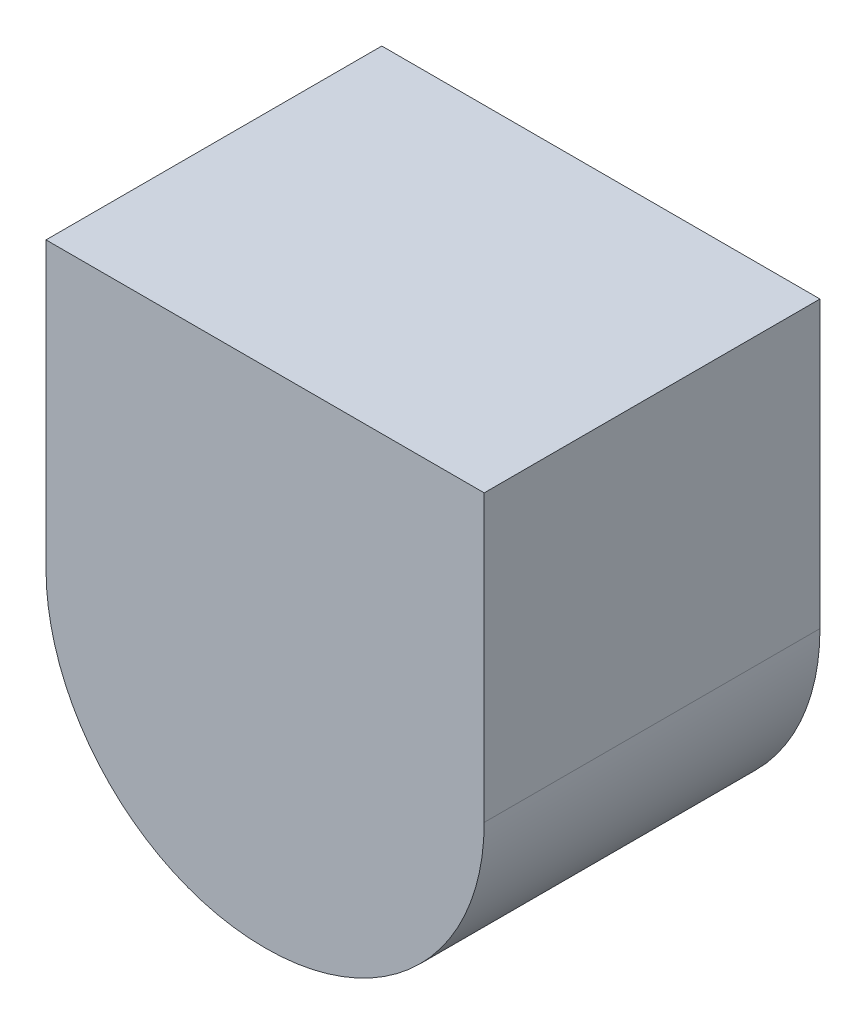
ISO-10303-21;
HEADER;
FILE_DESCRIPTION(('STEP AP214'),'2;1');
FILE_NAME('part.step','',(''),(''),'','','');
FILE_SCHEMA(('AUTOMOTIVE_DESIGN { 1 0 10303 214 1 1 1 1 }'));
ENDSEC;
DATA;
#1=APPLICATION_CONTEXT('core data for automotive mechanical design processes');
#2=APPLICATION_PROTOCOL_DEFINITION('international standard','automotive_design',2000,#1);
#3=PRODUCT_CONTEXT('',#1,'mechanical');
#4=PRODUCT('Part','Part','',(#3));
#5=PRODUCT_RELATED_PRODUCT_CATEGORY('part','',(#4));
#6=PRODUCT_DEFINITION_FORMATION('','',#4);
#7=PRODUCT_DEFINITION_CONTEXT('part definition',#1,'design');
#8=PRODUCT_DEFINITION('design','',#6,#7);
#9=PRODUCT_DEFINITION_SHAPE('','',#8);
#10=(LENGTH_UNIT() NAMED_UNIT(*) SI_UNIT(.MILLI.,.METRE.));
#11=(NAMED_UNIT(*) PLANE_ANGLE_UNIT() SI_UNIT($,.RADIAN.));
#12=(NAMED_UNIT(*) SI_UNIT($,.STERADIAN.) SOLID_ANGLE_UNIT());
#13=UNCERTAINTY_MEASURE_WITH_UNIT(LENGTH_MEASURE(1.E-05),#10,'distance_accuracy_value','');
#14=(GEOMETRIC_REPRESENTATION_CONTEXT(3) GLOBAL_UNCERTAINTY_ASSIGNED_CONTEXT((#13)) GLOBAL_UNIT_ASSIGNED_CONTEXT((#10,
#11,#12)) REPRESENTATION_CONTEXT('',''));
#15=CARTESIAN_POINT('',(0.,0.,0.));
#16=DIRECTION('',(0.,0.,1.));
#17=DIRECTION('',(1.,0.,0.));
#18=AXIS2_PLACEMENT_3D('',#15,#16,#17);
#19=CARTESIAN_POINT('',(0.63049912,2.99999908,0.1999996));
#20=DIRECTION('',(0.,0.,-1.));
#21=DIRECTION('',(-1.,0.,0.));
#22=AXIS2_PLACEMENT_3D('',#19,#20,#21);
#23=PLANE('',#22);
#24=DIRECTION('',(-1.,0.,0.));
#25=VECTOR('',#24,1.);
#26=CARTESIAN_POINT('',(0.36949888,2.69999968,0.1999996));
#27=LINE('',#26,#25);
#28=CARTESIAN_POINT('',(0.50049912,2.69999968,0.1999996));
#29=VERTEX_POINT('',#28);
#30=CARTESIAN_POINT('',(0.49949888,2.69999968,0.1999996));
#31=VERTEX_POINT('',#30);
#32=EDGE_CURVE('E11',#29,#31,#27,.T.);
#33=ORIENTED_EDGE('',*,*,#32,.F.);
#34=CARTESIAN_POINT('',(0.50049912,2.82999968,0.1999996));
#35=DIRECTION('',(0.,0.,-1.));
#36=DIRECTION('',(1.,0.,0.));
#37=AXIS2_PLACEMENT_3D('',#34,#35,#36);
#38=CIRCLE('',#37,0.13);
#39=CARTESIAN_POINT('',(0.63049912,2.82999968,0.1999996));
#40=VERTEX_POINT('',#39);
#41=EDGE_CURVE('E24',#40,#29,#38,.T.);
#42=ORIENTED_EDGE('',*,*,#41,.F.);
#43=DIRECTION('',(0.,-1.,0.));
#44=VECTOR('',#43,1.);
#45=CARTESIAN_POINT('',(0.63049912,2.99999908,0.1999996));
#46=LINE('',#45,#44);
#47=CARTESIAN_POINT('',(0.63049912,2.99999908,0.1999996));
#48=VERTEX_POINT('',#47);
#49=EDGE_CURVE('E117',#48,#40,#46,.T.);
#50=ORIENTED_EDGE('',*,*,#49,.F.);
#51=DIRECTION('',(1.,0.,0.));
#52=VECTOR('',#51,1.);
#53=CARTESIAN_POINT('',(0.63049912,2.99999908,0.1999996));
#54=LINE('',#53,#52);
#55=CARTESIAN_POINT('',(0.36949888,2.99999908,0.1999996));
#56=VERTEX_POINT('',#55);
#57=EDGE_CURVE('E115',#56,#48,#54,.T.);
#58=ORIENTED_EDGE('',*,*,#57,.F.);
#59=DIRECTION('',(0.,1.,0.));
#60=VECTOR('',#59,1.);
#61=CARTESIAN_POINT('',(0.36949888,2.99999908,0.1999996));
#62=LINE('',#61,#60);
#63=CARTESIAN_POINT('',(0.36949888,2.82999968,0.1999996));
#64=VERTEX_POINT('',#63);
#65=EDGE_CURVE('E73',#64,#56,#62,.T.);
#66=ORIENTED_EDGE('',*,*,#65,.F.);
#67=CARTESIAN_POINT('',(0.49949888,2.82999968,0.1999996));
#68=DIRECTION('',(0.,0.,-1.));
#69=DIRECTION('',(1.,0.,0.));
#70=AXIS2_PLACEMENT_3D('',#67,#68,#69);
#71=CIRCLE('',#70,0.13);
#72=EDGE_CURVE('E111',#31,#64,#71,.T.);
#73=ORIENTED_EDGE('',*,*,#72,.F.);
#74=EDGE_LOOP('',(#33,#42,#50,#58,#66,#73));
#75=FACE_BOUND('',#74,.T.);
#76=ADVANCED_FACE('F17',(#75),#23,.F.);
#77=CARTESIAN_POINT('',(0.49949888,2.82999968,0.));
#78=DIRECTION('',(0.,0.,1.));
#79=DIRECTION('',(1.,0.,0.));
#80=AXIS2_PLACEMENT_3D('',#77,#78,#79);
#81=CYLINDRICAL_SURFACE('',#80,0.13);
#82=ORIENTED_EDGE('',*,*,#72,.T.);
#83=DIRECTION('',(0.,0.,-1.));
#84=VECTOR('',#83,1.);
#85=CARTESIAN_POINT('',(0.36949888,2.82999968,0.));
#86=LINE('',#85,#84);
#87=CARTESIAN_POINT('',(0.36949888,2.82999968,0.));
#88=VERTEX_POINT('',#87);
#89=EDGE_CURVE('E109',#64,#88,#86,.T.);
#90=ORIENTED_EDGE('',*,*,#89,.T.);
#91=CARTESIAN_POINT('',(0.49949888,2.82999968,0.));
#92=DIRECTION('',(0.,0.,1.));
#93=DIRECTION('',(1.,0.,0.));
#94=AXIS2_PLACEMENT_3D('',#91,#92,#93);
#95=CIRCLE('',#94,0.13);
#96=CARTESIAN_POINT('',(0.49949888,2.69999968,0.));
#97=VERTEX_POINT('',#96);
#98=EDGE_CURVE('E89',#88,#97,#95,.T.);
#99=ORIENTED_EDGE('',*,*,#98,.T.);
#100=DIRECTION('',(0.,0.,1.));
#101=VECTOR('',#100,1.);
#102=CARTESIAN_POINT('',(0.49949888,2.69999968,0.));
#103=LINE('',#102,#101);
#104=EDGE_CURVE('E105',#97,#31,#103,.T.);
#105=ORIENTED_EDGE('',*,*,#104,.T.);
#106=EDGE_LOOP('',(#82,#90,#99,#105));
#107=FACE_BOUND('',#106,.T.);
#108=ADVANCED_FACE('F127',(#107),#81,.T.);
#109=CARTESIAN_POINT('',(0.36949888,2.69999968,0.));
#110=DIRECTION('',(0.,1.,0.));
#111=DIRECTION('',(-1.,0.,0.));
#112=AXIS2_PLACEMENT_3D('',#109,#110,#111);
#113=PLANE('',#112);
#114=DIRECTION('',(-1.,0.,0.));
#115=VECTOR('',#114,1.);
#116=CARTESIAN_POINT('',(0.63049912,2.69999968,0.));
#117=LINE('',#116,#115);
#118=CARTESIAN_POINT('',(0.50049912,2.69999968,0.));
#119=VERTEX_POINT('',#118);
#120=EDGE_CURVE('E103',#119,#97,#117,.T.);
#121=ORIENTED_EDGE('',*,*,#120,.F.);
#122=DIRECTION('',(0.,0.,-1.));
#123=VECTOR('',#122,1.);
#124=CARTESIAN_POINT('',(0.50049912,2.69999968,0.));
#125=LINE('',#124,#123);
#126=EDGE_CURVE('E100',#29,#119,#125,.T.);
#127=ORIENTED_EDGE('',*,*,#126,.F.);
#128=ORIENTED_EDGE('',*,*,#32,.T.);
#129=ORIENTED_EDGE('',*,*,#104,.F.);
#130=EDGE_LOOP('',(#121,#127,#128,#129));
#131=FACE_BOUND('',#130,.T.);
#132=ADVANCED_FACE('F123',(#131),#113,.F.);
#133=CARTESIAN_POINT('',(0.50049912,2.82999968,0.));
#134=DIRECTION('',(0.,0.,1.));
#135=DIRECTION('',(1.,0.,0.));
#136=AXIS2_PLACEMENT_3D('',#133,#134,#135);
#137=CYLINDRICAL_SURFACE('',#136,0.13);
#138=ORIENTED_EDGE('',*,*,#41,.T.);
#139=ORIENTED_EDGE('',*,*,#126,.T.);
#140=CARTESIAN_POINT('',(0.50049912,2.82999968,0.));
#141=DIRECTION('',(0.,0.,1.));
#142=DIRECTION('',(1.,0.,0.));
#143=AXIS2_PLACEMENT_3D('',#140,#141,#142);
#144=CIRCLE('',#143,0.13);
#145=CARTESIAN_POINT('',(0.63049912,2.82999968,0.));
#146=VERTEX_POINT('',#145);
#147=EDGE_CURVE('E98',#119,#146,#144,.T.);
#148=ORIENTED_EDGE('',*,*,#147,.T.);
#149=DIRECTION('',(0.,0.,1.));
#150=VECTOR('',#149,1.);
#151=CARTESIAN_POINT('',(0.63049912,2.82999968,0.));
#152=LINE('',#151,#150);
#153=EDGE_CURVE('E95',#146,#40,#152,.T.);
#154=ORIENTED_EDGE('',*,*,#153,.T.);
#155=EDGE_LOOP('',(#138,#139,#148,#154));
#156=FACE_BOUND('',#155,.T.);
#157=ADVANCED_FACE('F120',(#156),#137,.T.);
#158=CARTESIAN_POINT('',(0.63049912,2.69999968,0.));
#159=DIRECTION('',(-1.,0.,0.));
#160=DIRECTION('',(0.,-1.,0.));
#161=AXIS2_PLACEMENT_3D('',#158,#159,#160);
#162=PLANE('',#161);
#163=DIRECTION('',(0.,-1.,0.));
#164=VECTOR('',#163,1.);
#165=CARTESIAN_POINT('',(0.63049912,2.69999968,0.));
#166=LINE('',#165,#164);
#167=CARTESIAN_POINT('',(0.63049912,2.99999908,0.));
#168=VERTEX_POINT('',#167);
#169=EDGE_CURVE('E93',#168,#146,#166,.T.);
#170=ORIENTED_EDGE('',*,*,#169,.F.);
#171=DIRECTION('',(0.,0.,-1.));
#172=VECTOR('',#171,1.);
#173=CARTESIAN_POINT('',(0.63049912,2.99999908,0.));
#174=LINE('',#173,#172);
#175=EDGE_CURVE('E76',#48,#168,#174,.T.);
#176=ORIENTED_EDGE('',*,*,#175,.F.);
#177=ORIENTED_EDGE('',*,*,#49,.T.);
#178=ORIENTED_EDGE('',*,*,#153,.F.);
#179=EDGE_LOOP('',(#170,#176,#177,#178));
#180=FACE_BOUND('',#179,.T.);
#181=ADVANCED_FACE('F125',(#180),#162,.F.);
#182=CARTESIAN_POINT('',(0.63049912,2.99999908,0.));
#183=DIRECTION('',(0.,-1.,0.));
#184=DIRECTION('',(1.,0.,0.));
#185=AXIS2_PLACEMENT_3D('',#182,#183,#184);
#186=PLANE('',#185);
#187=DIRECTION('',(0.,0.,-1.));
#188=VECTOR('',#187,1.);
#189=CARTESIAN_POINT('',(0.36949888,2.99999908,0.));
#190=LINE('',#189,#188);
#191=CARTESIAN_POINT('',(0.36949888,2.99999908,0.));
#192=VERTEX_POINT('',#191);
#193=EDGE_CURVE('E67',#56,#192,#190,.T.);
#194=ORIENTED_EDGE('',*,*,#193,.F.);
#195=ORIENTED_EDGE('',*,*,#57,.T.);
#196=ORIENTED_EDGE('',*,*,#175,.T.);
#197=DIRECTION('',(1.,0.,0.));
#198=VECTOR('',#197,1.);
#199=CARTESIAN_POINT('',(0.63049912,2.99999908,0.));
#200=LINE('',#199,#198);
#201=EDGE_CURVE('E77',#192,#168,#200,.T.);
#202=ORIENTED_EDGE('',*,*,#201,.F.);
#203=EDGE_LOOP('',(#194,#195,#196,#202));
#204=FACE_BOUND('',#203,.T.);
#205=ADVANCED_FACE('F81',(#204),#186,.F.);
#206=CARTESIAN_POINT('',(0.36949888,2.99999908,0.));
#207=DIRECTION('',(1.,0.,0.));
#208=DIRECTION('',(0.,1.,0.));
#209=AXIS2_PLACEMENT_3D('',#206,#207,#208);
#210=PLANE('',#209);
#211=DIRECTION('',(0.,1.,0.));
#212=VECTOR('',#211,1.);
#213=CARTESIAN_POINT('',(0.36949888,2.99999908,0.));
#214=LINE('',#213,#212);
#215=EDGE_CURVE('E72',#88,#192,#214,.T.);
#216=ORIENTED_EDGE('',*,*,#215,.F.);
#217=ORIENTED_EDGE('',*,*,#89,.F.);
#218=ORIENTED_EDGE('',*,*,#65,.T.);
#219=ORIENTED_EDGE('',*,*,#193,.T.);
#220=EDGE_LOOP('',(#216,#217,#218,#219));
#221=FACE_BOUND('',#220,.T.);
#222=ADVANCED_FACE('F69',(#221),#210,.F.);
#223=CARTESIAN_POINT('',(0.63049912,2.99999908,0.));
#224=DIRECTION('',(0.,0.,-1.));
#225=DIRECTION('',(-1.,0.,0.));
#226=AXIS2_PLACEMENT_3D('',#223,#224,#225);
#227=PLANE('',#226);
#228=ORIENTED_EDGE('',*,*,#120,.T.);
#229=ORIENTED_EDGE('',*,*,#98,.F.);
#230=ORIENTED_EDGE('',*,*,#215,.T.);
#231=ORIENTED_EDGE('',*,*,#201,.T.);
#232=ORIENTED_EDGE('',*,*,#169,.T.);
#233=ORIENTED_EDGE('',*,*,#147,.F.);
#234=EDGE_LOOP('',(#228,#229,#230,#231,#232,#233));
#235=FACE_BOUND('',#234,.T.);
#236=ADVANCED_FACE('F88',(#235),#227,.T.);
#237=CLOSED_SHELL('',(#76,#108,#132,#157,#181,#205,#222,#236));
#238=MANIFOLD_SOLID_BREP('B1',#237);
#239=ADVANCED_BREP_SHAPE_REPRESENTATION('',(#18,#238),#14);
#240=SHAPE_DEFINITION_REPRESENTATION(#9,#239);
ENDSEC;
END-ISO-10303-21;
